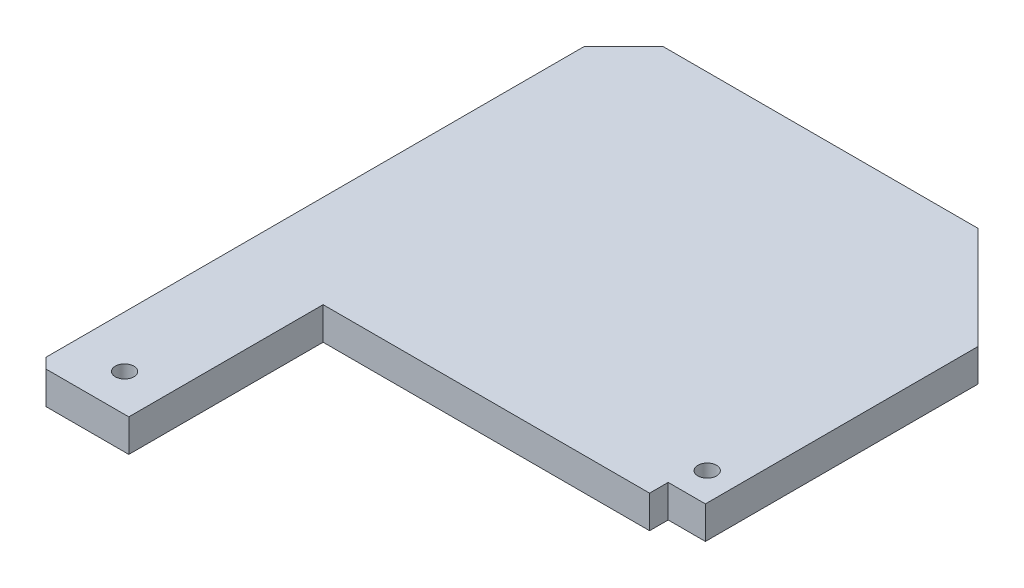
ISO-10303-21;
HEADER;
FILE_DESCRIPTION(('STEP AP214'),'2;1');
FILE_NAME('part.step','',(''),(''),'','','');
FILE_SCHEMA(('AUTOMOTIVE_DESIGN { 1 0 10303 214 1 1 1 1 }'));
ENDSEC;
DATA;
#1=APPLICATION_CONTEXT('core data for automotive mechanical design processes');
#2=APPLICATION_PROTOCOL_DEFINITION('international standard','automotive_design',2000,#1);
#3=PRODUCT_CONTEXT('',#1,'mechanical');
#4=PRODUCT('Part','Part','',(#3));
#5=PRODUCT_RELATED_PRODUCT_CATEGORY('part','',(#4));
#6=PRODUCT_DEFINITION_FORMATION('','',#4);
#7=PRODUCT_DEFINITION_CONTEXT('part definition',#1,'design');
#8=PRODUCT_DEFINITION('design','',#6,#7);
#9=PRODUCT_DEFINITION_SHAPE('','',#8);
#10=(LENGTH_UNIT() NAMED_UNIT(*) SI_UNIT(.MILLI.,.METRE.));
#11=(NAMED_UNIT(*) PLANE_ANGLE_UNIT() SI_UNIT($,.RADIAN.));
#12=(NAMED_UNIT(*) SI_UNIT($,.STERADIAN.) SOLID_ANGLE_UNIT());
#13=UNCERTAINTY_MEASURE_WITH_UNIT(LENGTH_MEASURE(1.E-05),#10,'distance_accuracy_value','');
#14=(GEOMETRIC_REPRESENTATION_CONTEXT(3) GLOBAL_UNCERTAINTY_ASSIGNED_CONTEXT((#13)) GLOBAL_UNIT_ASSIGNED_CONTEXT((#10,
#11,#12)) REPRESENTATION_CONTEXT('',''));
#15=CARTESIAN_POINT('',(0.,0.,0.));
#16=DIRECTION('',(0.,0.,1.));
#17=DIRECTION('',(1.,0.,0.));
#18=AXIS2_PLACEMENT_3D('',#15,#16,#17);
#19=CARTESIAN_POINT('',(-21.15,3.5,21.15));
#20=DIRECTION('',(1.,0.,0.));
#21=DIRECTION('',(0.,0.,-1.));
#22=AXIS2_PLACEMENT_3D('',#19,#20,#21);
#23=PLANE('',#22);
#24=DIRECTION('',(0.,0.,1.));
#25=VECTOR('',#24,1.);
#26=CARTESIAN_POINT('',(-21.15,0.,21.15));
#27=LINE('',#26,#25);
#28=CARTESIAN_POINT('',(-21.15,0.,-16.9073593128807));
#29=VERTEX_POINT('',#28);
#30=CARTESIAN_POINT('',(-21.15,0.,40.9365048251132));
#31=VERTEX_POINT('',#30);
#32=EDGE_CURVE('E185',#29,#31,#27,.T.);
#33=ORIENTED_EDGE('',*,*,#32,.T.);
#34=DIRECTION('',(0.,1.,0.));
#35=VECTOR('',#34,1.);
#36=CARTESIAN_POINT('',(-21.15,3.5,40.9365048251132));
#37=LINE('',#36,#35);
#38=CARTESIAN_POINT('',(-21.15,3.5,40.9365048251132));
#39=VERTEX_POINT('',#38);
#40=EDGE_CURVE('E193',#31,#39,#37,.T.);
#41=ORIENTED_EDGE('',*,*,#40,.T.);
#42=DIRECTION('',(0.,0.,1.));
#43=VECTOR('',#42,1.);
#44=CARTESIAN_POINT('',(-21.15,3.5,21.15));
#45=LINE('',#44,#43);
#46=CARTESIAN_POINT('',(-21.15,3.5,-16.9073593128807));
#47=VERTEX_POINT('',#46);
#48=EDGE_CURVE('E186',#47,#39,#45,.T.);
#49=ORIENTED_EDGE('',*,*,#48,.F.);
#50=DIRECTION('',(0.,1.,0.));
#51=VECTOR('',#50,1.);
#52=CARTESIAN_POINT('',(-21.15,-0.00100000000000013,-16.9073593128807));
#53=LINE('',#52,#51);
#54=EDGE_CURVE('E178',#29,#47,#53,.T.);
#55=ORIENTED_EDGE('',*,*,#54,.F.);
#56=EDGE_LOOP('',(#33,#41,#49,#55));
#57=FACE_BOUND('',#56,.T.);
#58=ADVANCED_FACE('F42',(#57),#23,.F.);
#59=CARTESIAN_POINT('',(21.15,3.5,21.15));
#60=DIRECTION('',(0.,0.,-1.));
#61=DIRECTION('',(-1.,0.,0.));
#62=AXIS2_PLACEMENT_3D('',#59,#60,#61);
#63=PLANE('',#62);
#64=DIRECTION('',(1.,0.,0.));
#65=VECTOR('',#64,1.);
#66=CARTESIAN_POINT('',(21.15,3.5,21.15));
#67=LINE('',#66,#65);
#68=CARTESIAN_POINT('',(-11.1500000000002,3.5,21.15));
#69=VERTEX_POINT('',#68);
#70=CARTESIAN_POINT('',(23.94,3.5,21.1499999999998));
#71=VERTEX_POINT('',#70);
#72=EDGE_CURVE('E188',#69,#71,#67,.T.);
#73=ORIENTED_EDGE('',*,*,#72,.F.);
#74=DIRECTION('',(0.,1.,0.));
#75=VECTOR('',#74,1.);
#76=CARTESIAN_POINT('',(-11.1500000000002,-27.0457751631369,21.1499999999998));
#77=LINE('',#76,#75);
#78=CARTESIAN_POINT('',(-11.1500000000002,0.,21.15));
#79=VERTEX_POINT('',#78);
#80=EDGE_CURVE('E142',#79,#69,#77,.T.);
#81=ORIENTED_EDGE('',*,*,#80,.F.);
#82=DIRECTION('',(1.,0.,0.));
#83=VECTOR('',#82,1.);
#84=CARTESIAN_POINT('',(21.15,0.,21.15));
#85=LINE('',#84,#83);
#86=CARTESIAN_POINT('',(23.94,0.,21.1499999999998));
#87=VERTEX_POINT('',#86);
#88=EDGE_CURVE('E196',#79,#87,#85,.T.);
#89=ORIENTED_EDGE('',*,*,#88,.T.);
#90=DIRECTION('',(0.,1.,0.));
#91=VECTOR('',#90,1.);
#92=CARTESIAN_POINT('',(23.94,-0.00100000000000013,21.1499999999998));
#93=LINE('',#92,#91);
#94=EDGE_CURVE('E163',#87,#71,#93,.T.);
#95=ORIENTED_EDGE('',*,*,#94,.T.);
#96=EDGE_LOOP('',(#73,#81,#89,#95));
#97=FACE_BOUND('',#96,.T.);
#98=ADVANCED_FACE('F238',(#97),#63,.F.);
#99=CARTESIAN_POINT('',(21.15,3.5,-21.15));
#100=DIRECTION('',(0.,0.,1.));
#101=DIRECTION('',(1.,0.,0.));
#102=AXIS2_PLACEMENT_3D('',#99,#100,#101);
#103=PLANE('',#102);
#104=DIRECTION('',(-1.,0.,0.));
#105=VECTOR('',#104,1.);
#106=CARTESIAN_POINT('',(21.15,3.5,-21.15));
#107=LINE('',#106,#105);
#108=CARTESIAN_POINT('',(16.94,3.5,-21.15));
#109=VERTEX_POINT('',#108);
#110=CARTESIAN_POINT('',(-16.9073593128807,3.5,-21.15));
#111=VERTEX_POINT('',#110);
#112=EDGE_CURVE('E191',#109,#111,#107,.T.);
#113=ORIENTED_EDGE('',*,*,#112,.F.);
#114=DIRECTION('',(0.,-1.,0.));
#115=VECTOR('',#114,1.);
#116=CARTESIAN_POINT('',(16.94,0.,-21.15));
#117=LINE('',#116,#115);
#118=CARTESIAN_POINT('',(16.94,0.,-21.15));
#119=VERTEX_POINT('',#118);
#120=EDGE_CURVE('E51',#109,#119,#117,.T.);
#121=ORIENTED_EDGE('',*,*,#120,.T.);
#122=DIRECTION('',(-1.,0.,0.));
#123=VECTOR('',#122,1.);
#124=CARTESIAN_POINT('',(21.15,0.,-21.15));
#125=LINE('',#124,#123);
#126=CARTESIAN_POINT('',(-16.9073593128807,0.,-21.15));
#127=VERTEX_POINT('',#126);
#128=EDGE_CURVE('E189',#119,#127,#125,.T.);
#129=ORIENTED_EDGE('',*,*,#128,.T.);
#130=DIRECTION('',(0.,1.,0.));
#131=VECTOR('',#130,1.);
#132=CARTESIAN_POINT('',(-16.9073593128807,-0.00100000000000013,-21.15));
#133=LINE('',#132,#131);
#134=EDGE_CURVE('E179',#127,#111,#133,.T.);
#135=ORIENTED_EDGE('',*,*,#134,.T.);
#136=EDGE_LOOP('',(#113,#121,#129,#135));
#137=FACE_BOUND('',#136,.T.);
#138=ADVANCED_FACE('F244',(#137),#103,.F.);
#139=CARTESIAN_POINT('',(0.,3.5,0.));
#140=DIRECTION('',(0.,1.,0.));
#141=DIRECTION('',(0.,0.,1.));
#142=AXIS2_PLACEMENT_3D('',#139,#140,#141);
#143=PLANE('',#142);
#144=CARTESIAN_POINT('',(24.94,3.5,15.956504825119));
#145=DIRECTION('',(0.,1.,0.));
#146=DIRECTION('',(0.,0.,1.));
#147=AXIS2_PLACEMENT_3D('',#144,#145,#146);
#148=CIRCLE('',#147,1.);
#149=CARTESIAN_POINT('',(24.94,3.5,16.956504825119));
#150=VERTEX_POINT('',#149);
#151=EDGE_CURVE('E459',#150,#150,#148,.F.);
#152=ORIENTED_EDGE('',*,*,#151,.T.);
#153=EDGE_LOOP('',(#152));
#154=FACE_BOUND('',#153,.T.);
#155=CARTESIAN_POINT('',(-15.6000000000002,3.5,38.036504825113));
#156=DIRECTION('',(0.,1.,0.));
#157=DIRECTION('',(0.,0.,1.));
#158=AXIS2_PLACEMENT_3D('',#155,#156,#157);
#159=CIRCLE('',#158,1.);
#160=CARTESIAN_POINT('',(-15.6000000000002,3.5,39.036504825113));
#161=VERTEX_POINT('',#160);
#162=EDGE_CURVE('E132',#161,#161,#159,.F.);
#163=ORIENTED_EDGE('',*,*,#162,.T.);
#164=EDGE_LOOP('',(#163));
#165=FACE_BOUND('',#164,.T.);
#166=DIRECTION('',(0.,0.,1.));
#167=VECTOR('',#166,1.);
#168=CARTESIAN_POINT('',(27.94,3.5,21.15));
#169=LINE('',#168,#167);
#170=CARTESIAN_POINT('',(27.94,3.5,-10.15));
#171=VERTEX_POINT('',#170);
#172=CARTESIAN_POINT('',(27.94,3.5,19.1499999999998));
#173=VERTEX_POINT('',#172);
#174=EDGE_CURVE('E173',#171,#173,#169,.T.);
#175=ORIENTED_EDGE('',*,*,#174,.F.);
#176=DIRECTION('',(-0.707106781186549,0.,-0.707106781186546));
#177=VECTOR('',#176,1.);
#178=CARTESIAN_POINT('',(19.0449999999999,3.5,-19.045));
#179=LINE('',#178,#177);
#180=EDGE_CURVE('E65',#171,#109,#179,.T.);
#181=ORIENTED_EDGE('',*,*,#180,.T.);
#182=ORIENTED_EDGE('',*,*,#112,.T.);
#183=DIRECTION('',(0.707106781186547,0.,-0.707106781186548));
#184=VECTOR('',#183,1.);
#185=CARTESIAN_POINT('',(-21.15,3.5,-16.9073593128807));
#186=LINE('',#185,#184);
#187=EDGE_CURVE('E175',#47,#111,#186,.T.);
#188=ORIENTED_EDGE('',*,*,#187,.F.);
#189=ORIENTED_EDGE('',*,*,#48,.T.);
#190=DIRECTION('',(0.70710678118655,0.,0.707106781186545));
#191=VECTOR('',#190,1.);
#192=CARTESIAN_POINT('',(-31.0432524125565,3.5,31.0432524125567));
#193=LINE('',#192,#191);
#194=CARTESIAN_POINT('',(-20.0500000000002,3.5,42.036504825113));
#195=VERTEX_POINT('',#194);
#196=EDGE_CURVE('E129',#39,#195,#193,.T.);
#197=ORIENTED_EDGE('',*,*,#196,.T.);
#198=DIRECTION('',(1.,0.,0.));
#199=VECTOR('',#198,1.);
#200=CARTESIAN_POINT('',(-21.1500000000002,3.5,42.036504825113));
#201=LINE('',#200,#199);
#202=CARTESIAN_POINT('',(-11.1500000000002,3.5,42.036504825113));
#203=VERTEX_POINT('',#202);
#204=EDGE_CURVE('E123',#195,#203,#201,.T.);
#205=ORIENTED_EDGE('',*,*,#204,.T.);
#206=DIRECTION('',(0.,0.,-1.));
#207=VECTOR('',#206,1.);
#208=CARTESIAN_POINT('',(-11.1500000000002,3.5,42.036504825113));
#209=LINE('',#208,#207);
#210=EDGE_CURVE('E127',#203,#69,#209,.T.);
#211=ORIENTED_EDGE('',*,*,#210,.T.);
#212=ORIENTED_EDGE('',*,*,#72,.T.);
#213=DIRECTION('',(0.,0.,1.));
#214=VECTOR('',#213,1.);
#215=CARTESIAN_POINT('',(23.94,3.5,21.1499999999998));
#216=LINE('',#215,#214);
#217=CARTESIAN_POINT('',(23.94,3.5,19.1499999999998));
#218=VERTEX_POINT('',#217);
#219=EDGE_CURVE('E159',#218,#71,#216,.T.);
#220=ORIENTED_EDGE('',*,*,#219,.F.);
#221=DIRECTION('',(-1.,0.,0.));
#222=VECTOR('',#221,1.);
#223=CARTESIAN_POINT('',(23.94,3.5,19.1499999999998));
#224=LINE('',#223,#222);
#225=EDGE_CURVE('E156',#173,#218,#224,.T.);
#226=ORIENTED_EDGE('',*,*,#225,.F.);
#227=EDGE_LOOP('',(#175,#181,#182,#188,#189,#197,#205,#211,#212,#220,#226));
#228=FACE_BOUND('',#227,.T.);
#229=ADVANCED_FACE('F125',(#154,#165,#228),#143,.T.);
#230=CARTESIAN_POINT('',(0.,0.,0.));
#231=DIRECTION('',(0.,1.,0.));
#232=DIRECTION('',(0.,0.,1.));
#233=AXIS2_PLACEMENT_3D('',#230,#231,#232);
#234=PLANE('',#233);
#235=CARTESIAN_POINT('',(24.94,0.,15.956504825119));
#236=DIRECTION('',(0.,-1.,0.));
#237=DIRECTION('',(0.,0.,-1.));
#238=AXIS2_PLACEMENT_3D('',#235,#236,#237);
#239=CIRCLE('',#238,1.);
#240=CARTESIAN_POINT('',(24.94,0.,14.956504825119));
#241=VERTEX_POINT('',#240);
#242=EDGE_CURVE('E462',#241,#241,#239,.T.);
#243=ORIENTED_EDGE('',*,*,#242,.F.);
#244=EDGE_LOOP('',(#243));
#245=FACE_BOUND('',#244,.T.);
#246=CARTESIAN_POINT('',(-15.6000000000002,0.,38.036504825113));
#247=DIRECTION('',(0.,-1.,0.));
#248=DIRECTION('',(0.,0.,-1.));
#249=AXIS2_PLACEMENT_3D('',#246,#247,#248);
#250=CIRCLE('',#249,1.);
#251=CARTESIAN_POINT('',(-15.6000000000002,0.,37.036504825113));
#252=VERTEX_POINT('',#251);
#253=EDGE_CURVE('E456',#252,#252,#250,.T.);
#254=ORIENTED_EDGE('',*,*,#253,.F.);
#255=EDGE_LOOP('',(#254));
#256=FACE_BOUND('',#255,.T.);
#257=ORIENTED_EDGE('',*,*,#128,.F.);
#258=DIRECTION('',(0.707106781186549,0.,0.707106781186546));
#259=VECTOR('',#258,1.);
#260=CARTESIAN_POINT('',(27.94,0.,-10.15));
#261=LINE('',#260,#259);
#262=CARTESIAN_POINT('',(27.94,0.,-10.15));
#263=VERTEX_POINT('',#262);
#264=EDGE_CURVE('E11',#119,#263,#261,.T.);
#265=ORIENTED_EDGE('',*,*,#264,.T.);
#266=DIRECTION('',(0.,0.,-1.));
#267=VECTOR('',#266,1.);
#268=CARTESIAN_POINT('',(27.94,0.,21.15));
#269=LINE('',#268,#267);
#270=CARTESIAN_POINT('',(27.94,0.,19.1499999999998));
#271=VERTEX_POINT('',#270);
#272=EDGE_CURVE('E166',#271,#263,#269,.T.);
#273=ORIENTED_EDGE('',*,*,#272,.F.);
#274=DIRECTION('',(1.,0.,0.));
#275=VECTOR('',#274,1.);
#276=CARTESIAN_POINT('',(23.94,0.,19.1499999999998));
#277=LINE('',#276,#275);
#278=CARTESIAN_POINT('',(23.94,0.,19.1499999999998));
#279=VERTEX_POINT('',#278);
#280=EDGE_CURVE('E150',#279,#271,#277,.T.);
#281=ORIENTED_EDGE('',*,*,#280,.F.);
#282=DIRECTION('',(0.,0.,-1.));
#283=VECTOR('',#282,1.);
#284=CARTESIAN_POINT('',(23.94,0.,21.1499999999998));
#285=LINE('',#284,#283);
#286=EDGE_CURVE('E152',#87,#279,#285,.T.);
#287=ORIENTED_EDGE('',*,*,#286,.F.);
#288=ORIENTED_EDGE('',*,*,#88,.F.);
#289=DIRECTION('',(0.,0.,1.));
#290=VECTOR('',#289,1.);
#291=CARTESIAN_POINT('',(-11.1500000000002,0.,42.036504825113));
#292=LINE('',#291,#290);
#293=CARTESIAN_POINT('',(-11.1500000000002,0.,42.036504825113));
#294=VERTEX_POINT('',#293);
#295=EDGE_CURVE('E153',#79,#294,#292,.T.);
#296=ORIENTED_EDGE('',*,*,#295,.T.);
#297=DIRECTION('',(-1.,0.,0.));
#298=VECTOR('',#297,1.);
#299=CARTESIAN_POINT('',(-21.1500000000002,0.,42.036504825113));
#300=LINE('',#299,#298);
#301=CARTESIAN_POINT('',(-20.0500000000002,0.,42.036504825113));
#302=VERTEX_POINT('',#301);
#303=EDGE_CURVE('E139',#294,#302,#300,.T.);
#304=ORIENTED_EDGE('',*,*,#303,.T.);
#305=DIRECTION('',(-0.70710678118655,0.,-0.707106781186545));
#306=VECTOR('',#305,1.);
#307=CARTESIAN_POINT('',(-21.15,0.,40.9365048251132));
#308=LINE('',#307,#306);
#309=EDGE_CURVE('E204',#302,#31,#308,.T.);
#310=ORIENTED_EDGE('',*,*,#309,.T.);
#311=ORIENTED_EDGE('',*,*,#32,.F.);
#312=DIRECTION('',(-0.707106781186547,0.,0.707106781186548));
#313=VECTOR('',#312,1.);
#314=CARTESIAN_POINT('',(-21.15,0.,-16.9073593128807));
#315=LINE('',#314,#313);
#316=EDGE_CURVE('E182',#127,#29,#315,.T.);
#317=ORIENTED_EDGE('',*,*,#316,.F.);
#318=EDGE_LOOP('',(#257,#265,#273,#281,#287,#288,#296,#304,#310,#311,#317));
#319=FACE_BOUND('',#318,.T.);
#320=ADVANCED_FACE('F222',(#245,#256,#319),#234,.F.);
#321=CARTESIAN_POINT('',(-21.15,-0.00100000000000013,-16.9073593128807));
#322=DIRECTION('',(0.707106781186548,0.,0.707106781186547));
#323=DIRECTION('',(0.707106781186547,0.,-0.707106781186548));
#324=AXIS2_PLACEMENT_3D('',#321,#322,#323);
#325=PLANE('',#324);
#326=ORIENTED_EDGE('',*,*,#316,.T.);
#327=ORIENTED_EDGE('',*,*,#54,.T.);
#328=ORIENTED_EDGE('',*,*,#187,.T.);
#329=ORIENTED_EDGE('',*,*,#134,.F.);
#330=EDGE_LOOP('',(#326,#327,#328,#329));
#331=FACE_BOUND('',#330,.T.);
#332=ADVANCED_FACE('F264',(#331),#325,.F.);
#333=CARTESIAN_POINT('',(27.94,0.,0.));
#334=DIRECTION('',(1.,0.,0.));
#335=DIRECTION('',(0.,0.,-1.));
#336=AXIS2_PLACEMENT_3D('',#333,#334,#335);
#337=PLANE('',#336);
#338=ORIENTED_EDGE('',*,*,#272,.T.);
#339=DIRECTION('',(0.,1.,0.));
#340=VECTOR('',#339,1.);
#341=CARTESIAN_POINT('',(27.94,3.5,-10.15));
#342=LINE('',#341,#340);
#343=EDGE_CURVE('E206',#263,#171,#342,.T.);
#344=ORIENTED_EDGE('',*,*,#343,.T.);
#345=ORIENTED_EDGE('',*,*,#174,.T.);
#346=DIRECTION('',(0.,1.,0.));
#347=VECTOR('',#346,1.);
#348=CARTESIAN_POINT('',(27.94,-0.00100000000000013,19.1499999999998));
#349=LINE('',#348,#347);
#350=EDGE_CURVE('E162',#271,#173,#349,.T.);
#351=ORIENTED_EDGE('',*,*,#350,.F.);
#352=EDGE_LOOP('',(#338,#344,#345,#351));
#353=FACE_BOUND('',#352,.T.);
#354=ADVANCED_FACE('F211',(#353),#337,.T.);
#355=CARTESIAN_POINT('',(23.94,-0.00100000000000013,21.1499999999998));
#356=DIRECTION('',(-1.,0.,0.));
#357=DIRECTION('',(0.,0.,1.));
#358=AXIS2_PLACEMENT_3D('',#355,#356,#357);
#359=PLANE('',#358);
#360=ORIENTED_EDGE('',*,*,#286,.T.);
#361=DIRECTION('',(0.,1.,0.));
#362=VECTOR('',#361,1.);
#363=CARTESIAN_POINT('',(23.94,-0.00100000000000013,19.1499999999998));
#364=LINE('',#363,#362);
#365=EDGE_CURVE('E167',#279,#218,#364,.T.);
#366=ORIENTED_EDGE('',*,*,#365,.T.);
#367=ORIENTED_EDGE('',*,*,#219,.T.);
#368=ORIENTED_EDGE('',*,*,#94,.F.);
#369=EDGE_LOOP('',(#360,#366,#367,#368));
#370=FACE_BOUND('',#369,.T.);
#371=ADVANCED_FACE('F280',(#370),#359,.F.);
#372=CARTESIAN_POINT('',(23.94,-0.00100000000000013,19.1499999999998));
#373=DIRECTION('',(0.,0.,-1.));
#374=DIRECTION('',(-1.,0.,0.));
#375=AXIS2_PLACEMENT_3D('',#372,#373,#374);
#376=PLANE('',#375);
#377=ORIENTED_EDGE('',*,*,#280,.T.);
#378=ORIENTED_EDGE('',*,*,#350,.T.);
#379=ORIENTED_EDGE('',*,*,#225,.T.);
#380=ORIENTED_EDGE('',*,*,#365,.F.);
#381=EDGE_LOOP('',(#377,#378,#379,#380));
#382=FACE_BOUND('',#381,.T.);
#383=ADVANCED_FACE('F219',(#382),#376,.F.);
#384=CARTESIAN_POINT('',(-11.1500000000002,-27.0457751631369,42.036504825113));
#385=DIRECTION('',(1.,0.,0.));
#386=DIRECTION('',(0.,0.,-1.));
#387=AXIS2_PLACEMENT_3D('',#384,#385,#386);
#388=PLANE('',#387);
#389=ORIENTED_EDGE('',*,*,#295,.F.);
#390=ORIENTED_EDGE('',*,*,#80,.T.);
#391=ORIENTED_EDGE('',*,*,#210,.F.);
#392=DIRECTION('',(0.,1.,0.));
#393=VECTOR('',#392,1.);
#394=CARTESIAN_POINT('',(-11.1500000000002,-27.0457751631369,42.036504825113));
#395=LINE('',#394,#393);
#396=EDGE_CURVE('E136',#294,#203,#395,.T.);
#397=ORIENTED_EDGE('',*,*,#396,.F.);
#398=EDGE_LOOP('',(#389,#390,#391,#397));
#399=FACE_BOUND('',#398,.T.);
#400=ADVANCED_FACE('F145',(#399),#388,.T.);
#401=CARTESIAN_POINT('',(-21.1500000000002,-27.0457751631369,42.036504825113));
#402=DIRECTION('',(0.,0.,1.));
#403=DIRECTION('',(1.,0.,0.));
#404=AXIS2_PLACEMENT_3D('',#401,#402,#403);
#405=PLANE('',#404);
#406=ORIENTED_EDGE('',*,*,#204,.F.);
#407=DIRECTION('',(0.,-1.,0.));
#408=VECTOR('',#407,1.);
#409=CARTESIAN_POINT('',(-20.0500000000002,0.,42.036504825113));
#410=LINE('',#409,#408);
#411=EDGE_CURVE('E202',#195,#302,#410,.T.);
#412=ORIENTED_EDGE('',*,*,#411,.T.);
#413=ORIENTED_EDGE('',*,*,#303,.F.);
#414=ORIENTED_EDGE('',*,*,#396,.T.);
#415=EDGE_LOOP('',(#406,#412,#413,#414));
#416=FACE_BOUND('',#415,.T.);
#417=ADVANCED_FACE('F137',(#416),#405,.T.);
#418=CARTESIAN_POINT('',(-21.15,3.5,40.9365048251132));
#419=DIRECTION('',(-0.707106781186545,0.,0.70710678118655));
#420=DIRECTION('',(0.,-1.,0.));
#421=AXIS2_PLACEMENT_3D('',#418,#419,#420);
#422=PLANE('',#421);
#423=ORIENTED_EDGE('',*,*,#309,.F.);
#424=ORIENTED_EDGE('',*,*,#411,.F.);
#425=ORIENTED_EDGE('',*,*,#196,.F.);
#426=ORIENTED_EDGE('',*,*,#40,.F.);
#427=EDGE_LOOP('',(#423,#424,#425,#426));
#428=FACE_BOUND('',#427,.T.);
#429=ADVANCED_FACE('F234',(#428),#422,.T.);
#430=CARTESIAN_POINT('',(-15.6000000000002,6.32842712474619,38.036504825113));
#431=DIRECTION('',(0.,-1.,0.));
#432=DIRECTION('',(0.,0.,-1.));
#433=AXIS2_PLACEMENT_3D('',#430,#431,#432);
#434=CYLINDRICAL_SURFACE('',#433,1.);
#435=ORIENTED_EDGE('',*,*,#253,.T.);
#436=EDGE_LOOP('',(#435));
#437=FACE_BOUND('',#436,.T.);
#438=ORIENTED_EDGE('',*,*,#162,.F.);
#439=EDGE_LOOP('',(#438));
#440=FACE_BOUND('',#439,.T.);
#441=ADVANCED_FACE('F227',(#437,#440),#434,.F.);
#442=CARTESIAN_POINT('',(27.94,0.,-10.15));
#443=DIRECTION('',(0.707106781186546,0.,-0.707106781186549));
#444=DIRECTION('',(0.,-1.,0.));
#445=AXIS2_PLACEMENT_3D('',#442,#443,#444);
#446=PLANE('',#445);
#447=ORIENTED_EDGE('',*,*,#264,.F.);
#448=ORIENTED_EDGE('',*,*,#120,.F.);
#449=ORIENTED_EDGE('',*,*,#180,.F.);
#450=ORIENTED_EDGE('',*,*,#343,.F.);
#451=EDGE_LOOP('',(#447,#448,#449,#450));
#452=FACE_BOUND('',#451,.T.);
#453=ADVANCED_FACE('F45',(#452),#446,.T.);
#454=CARTESIAN_POINT('',(24.94,6.32842712474619,15.956504825119));
#455=DIRECTION('',(0.,-1.,0.));
#456=DIRECTION('',(0.,0.,-1.));
#457=AXIS2_PLACEMENT_3D('',#454,#455,#456);
#458=CYLINDRICAL_SURFACE('',#457,1.);
#459=ORIENTED_EDGE('',*,*,#242,.T.);
#460=EDGE_LOOP('',(#459));
#461=FACE_BOUND('',#460,.T.);
#462=ORIENTED_EDGE('',*,*,#151,.F.);
#463=EDGE_LOOP('',(#462));
#464=FACE_BOUND('',#463,.T.);
#465=ADVANCED_FACE('F226',(#461,#464),#458,.F.);
#466=CLOSED_SHELL('',(#58,#98,#138,#229,#320,#332,#354,#371,#383,#400,#417,#429,#441,#453,#465));
#467=MANIFOLD_SOLID_BREP('B2',#466);
#468=ADVANCED_BREP_SHAPE_REPRESENTATION('',(#18,#467),#14);
#469=SHAPE_DEFINITION_REPRESENTATION(#9,#468);
ENDSEC;
END-ISO-10303-21;
